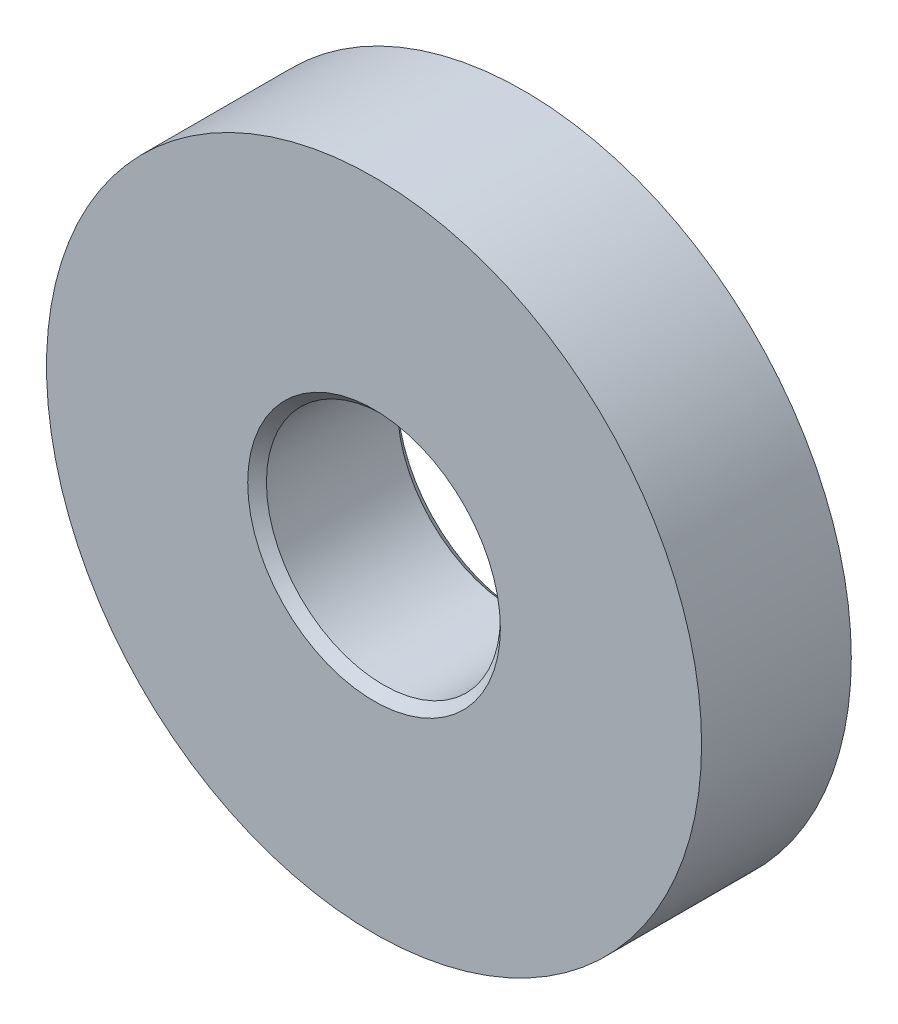
ISO-10303-21;
HEADER;
FILE_DESCRIPTION(('STEP AP214'),'2;1');
FILE_NAME('part.step','',(''),(''),'','','');
FILE_SCHEMA(('AUTOMOTIVE_DESIGN { 1 0 10303 214 1 1 1 1 }'));
ENDSEC;
DATA;
#1=APPLICATION_CONTEXT('core data for automotive mechanical design processes');
#2=APPLICATION_PROTOCOL_DEFINITION('international standard','automotive_design',2000,#1);
#3=PRODUCT_CONTEXT('',#1,'mechanical');
#4=PRODUCT('Part','Part','',(#3));
#5=PRODUCT_RELATED_PRODUCT_CATEGORY('part','',(#4));
#6=PRODUCT_DEFINITION_FORMATION('','',#4);
#7=PRODUCT_DEFINITION_CONTEXT('part definition',#1,'design');
#8=PRODUCT_DEFINITION('design','',#6,#7);
#9=PRODUCT_DEFINITION_SHAPE('','',#8);
#10=(LENGTH_UNIT() NAMED_UNIT(*) SI_UNIT(.MILLI.,.METRE.));
#11=(NAMED_UNIT(*) PLANE_ANGLE_UNIT() SI_UNIT($,.RADIAN.));
#12=(NAMED_UNIT(*) SI_UNIT($,.STERADIAN.) SOLID_ANGLE_UNIT());
#13=UNCERTAINTY_MEASURE_WITH_UNIT(LENGTH_MEASURE(1.E-05),#10,'distance_accuracy_value','');
#14=(GEOMETRIC_REPRESENTATION_CONTEXT(3) GLOBAL_UNCERTAINTY_ASSIGNED_CONTEXT((#13)) GLOBAL_UNIT_ASSIGNED_CONTEXT((#10,
#11,#12)) REPRESENTATION_CONTEXT('',''));
#15=CARTESIAN_POINT('',(0.,0.,0.));
#16=DIRECTION('',(0.,0.,1.));
#17=DIRECTION('',(1.,0.,0.));
#18=AXIS2_PLACEMENT_3D('',#15,#16,#17);
#19=CARTESIAN_POINT('',(0.,0.,-1.6));
#20=DIRECTION('',(0.,0.,1.));
#21=DIRECTION('',(1.,0.,0.));
#22=AXIS2_PLACEMENT_3D('',#19,#20,#21);
#23=CYLINDRICAL_SURFACE('',#22,3.5);
#24=CARTESIAN_POINT('',(0.,0.,-1.6));
#25=DIRECTION('',(0.,0.,1.));
#26=DIRECTION('',(1.,0.,0.));
#27=AXIS2_PLACEMENT_3D('',#24,#25,#26);
#28=CIRCLE('',#27,3.5);
#29=CARTESIAN_POINT('',(3.5,0.,-1.6));
#30=VERTEX_POINT('',#29);
#31=EDGE_CURVE('E67',#30,#30,#28,.T.);
#32=ORIENTED_EDGE('',*,*,#31,.T.);
#33=EDGE_LOOP('',(#32));
#34=FACE_BOUND('',#33,.T.);
#35=CARTESIAN_POINT('',(0.,0.,0.));
#36=DIRECTION('',(0.,0.,1.));
#37=DIRECTION('',(1.,0.,0.));
#38=AXIS2_PLACEMENT_3D('',#35,#36,#37);
#39=CIRCLE('',#38,3.5);
#40=CARTESIAN_POINT('',(3.5,0.,0.));
#41=VERTEX_POINT('',#40);
#42=EDGE_CURVE('E68',#41,#41,#39,.T.);
#43=ORIENTED_EDGE('',*,*,#42,.F.);
#44=EDGE_LOOP('',(#43));
#45=FACE_BOUND('',#44,.T.);
#46=ADVANCED_FACE('F47',(#34,#45),#23,.T.);
#47=CARTESIAN_POINT('',(0.,0.,-1.6));
#48=DIRECTION('',(0.,0.,1.));
#49=DIRECTION('',(1.,0.,0.));
#50=AXIS2_PLACEMENT_3D('',#47,#48,#49);
#51=PLANE('',#50);
#52=CARTESIAN_POINT('',(0.,0.,-1.6));
#53=DIRECTION('',(0.,0.,1.));
#54=DIRECTION('',(1.,0.,0.));
#55=AXIS2_PLACEMENT_3D('',#52,#53,#54);
#56=CIRCLE('',#55,1.35);
#57=CARTESIAN_POINT('',(1.35,0.,-1.6));
#58=VERTEX_POINT('',#57);
#59=EDGE_CURVE('E62',#58,#58,#56,.T.);
#60=ORIENTED_EDGE('',*,*,#59,.T.);
#61=EDGE_LOOP('',(#60));
#62=FACE_BOUND('',#61,.T.);
#63=ORIENTED_EDGE('',*,*,#31,.F.);
#64=EDGE_LOOP('',(#63));
#65=FACE_BOUND('',#64,.T.);
#66=ADVANCED_FACE('F76',(#62,#65),#51,.F.);
#67=CARTESIAN_POINT('',(0.,0.,0.));
#68=DIRECTION('',(0.,0.,1.));
#69=DIRECTION('',(1.,0.,0.));
#70=AXIS2_PLACEMENT_3D('',#67,#68,#69);
#71=PLANE('',#70);
#72=CARTESIAN_POINT('',(0.,0.,0.));
#73=DIRECTION('',(0.,0.,1.));
#74=DIRECTION('',(1.,0.,0.));
#75=AXIS2_PLACEMENT_3D('',#72,#73,#74);
#76=CIRCLE('',#75,1.35);
#77=CARTESIAN_POINT('',(1.35,0.,0.));
#78=VERTEX_POINT('',#77);
#79=EDGE_CURVE('E12',#78,#78,#76,.F.);
#80=ORIENTED_EDGE('',*,*,#79,.T.);
#81=EDGE_LOOP('',(#80));
#82=FACE_BOUND('',#81,.T.);
#83=ORIENTED_EDGE('',*,*,#42,.T.);
#84=EDGE_LOOP('',(#83));
#85=FACE_BOUND('',#84,.T.);
#86=ADVANCED_FACE('F78',(#82,#85),#71,.T.);
#87=CARTESIAN_POINT('',(0.,0.,-1.6));
#88=DIRECTION('',(0.,0.,1.));
#89=DIRECTION('',(1.,0.,0.));
#90=AXIS2_PLACEMENT_3D('',#87,#88,#89);
#91=CYLINDRICAL_SURFACE('',#90,1.25);
#92=CARTESIAN_POINT('',(0.,0.,-1.5));
#93=DIRECTION('',(0.,0.,1.));
#94=DIRECTION('',(1.,0.,0.));
#95=AXIS2_PLACEMENT_3D('',#92,#93,#94);
#96=CIRCLE('',#95,1.25);
#97=CARTESIAN_POINT('',(1.25,0.,-1.5));
#98=VERTEX_POINT('',#97);
#99=EDGE_CURVE('E54',#98,#98,#96,.F.);
#100=ORIENTED_EDGE('',*,*,#99,.T.);
#101=EDGE_LOOP('',(#100));
#102=FACE_BOUND('',#101,.T.);
#103=CARTESIAN_POINT('',(0.,0.,-0.0999999999999996));
#104=DIRECTION('',(0.,0.,1.));
#105=DIRECTION('',(1.,0.,0.));
#106=AXIS2_PLACEMENT_3D('',#103,#104,#105);
#107=CIRCLE('',#106,1.25);
#108=CARTESIAN_POINT('',(1.25,0.,-0.0999999999999996));
#109=VERTEX_POINT('',#108);
#110=EDGE_CURVE('E58',#109,#109,#107,.T.);
#111=ORIENTED_EDGE('',*,*,#110,.T.);
#112=EDGE_LOOP('',(#111));
#113=FACE_BOUND('',#112,.T.);
#114=ADVANCED_FACE('F85',(#102,#113),#91,.F.);
#115=CARTESIAN_POINT('',(0.,0.,-1.6));
#116=DIRECTION('',(0.,0.,-1.));
#117=DIRECTION('',(-1.,0.,0.));
#118=AXIS2_PLACEMENT_3D('',#115,#116,#117);
#119=CONICAL_SURFACE('',#118,1.35,0.785398163397447);
#120=ORIENTED_EDGE('',*,*,#99,.F.);
#121=EDGE_LOOP('',(#120));
#122=FACE_BOUND('',#121,.T.);
#123=ORIENTED_EDGE('',*,*,#59,.F.);
#124=EDGE_LOOP('',(#123));
#125=FACE_BOUND('',#124,.T.);
#126=ADVANCED_FACE('F89',(#122,#125),#119,.F.);
#127=CARTESIAN_POINT('',(0.,0.,-0.0999999999999996));
#128=DIRECTION('',(0.,0.,1.));
#129=DIRECTION('',(1.,0.,0.));
#130=AXIS2_PLACEMENT_3D('',#127,#128,#129);
#131=CONICAL_SURFACE('',#130,1.25,0.785398163397453);
#132=ORIENTED_EDGE('',*,*,#79,.F.);
#133=EDGE_LOOP('',(#132));
#134=FACE_BOUND('',#133,.T.);
#135=ORIENTED_EDGE('',*,*,#110,.F.);
#136=EDGE_LOOP('',(#135));
#137=FACE_BOUND('',#136,.T.);
#138=ADVANCED_FACE('F49',(#134,#137),#131,.F.);
#139=CLOSED_SHELL('',(#46,#66,#86,#114,#126,#138));
#140=MANIFOLD_SOLID_BREP('B2',#139);
#141=ADVANCED_BREP_SHAPE_REPRESENTATION('',(#18,#140),#14);
#142=SHAPE_DEFINITION_REPRESENTATION(#9,#141);
ENDSEC;
END-ISO-10303-21;
